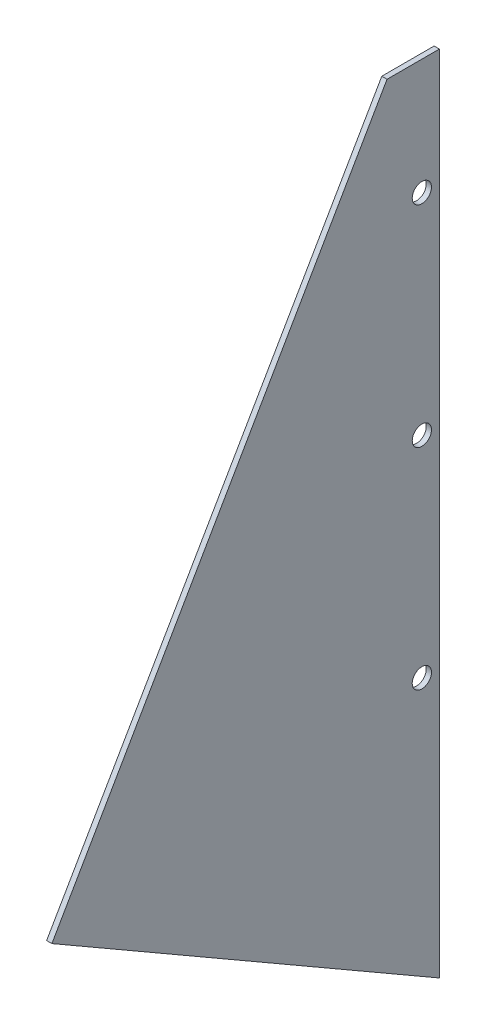
ISO-10303-21;
HEADER;
FILE_DESCRIPTION(('STEP AP214'),'2;1');
FILE_NAME('part.step','',(''),(''),'','','');
FILE_SCHEMA(('AUTOMOTIVE_DESIGN { 1 0 10303 214 1 1 1 1 }'));
ENDSEC;
DATA;
#1=APPLICATION_CONTEXT('core data for automotive mechanical design processes');
#2=APPLICATION_PROTOCOL_DEFINITION('international standard','automotive_design',2000,#1);
#3=PRODUCT_CONTEXT('',#1,'mechanical');
#4=PRODUCT('Part','Part','',(#3));
#5=PRODUCT_RELATED_PRODUCT_CATEGORY('part','',(#4));
#6=PRODUCT_DEFINITION_FORMATION('','',#4);
#7=PRODUCT_DEFINITION_CONTEXT('part definition',#1,'design');
#8=PRODUCT_DEFINITION('design','',#6,#7);
#9=PRODUCT_DEFINITION_SHAPE('','',#8);
#10=(LENGTH_UNIT() NAMED_UNIT(*) SI_UNIT(.MILLI.,.METRE.));
#11=(NAMED_UNIT(*) PLANE_ANGLE_UNIT() SI_UNIT($,.RADIAN.));
#12=(NAMED_UNIT(*) SI_UNIT($,.STERADIAN.) SOLID_ANGLE_UNIT());
#13=UNCERTAINTY_MEASURE_WITH_UNIT(LENGTH_MEASURE(1.E-05),#10,'distance_accuracy_value','');
#14=(GEOMETRIC_REPRESENTATION_CONTEXT(3) GLOBAL_UNCERTAINTY_ASSIGNED_CONTEXT((#13)) GLOBAL_UNIT_ASSIGNED_CONTEXT((#10,
#11,#12)) REPRESENTATION_CONTEXT('',''));
#15=CARTESIAN_POINT('',(0.,0.,0.));
#16=DIRECTION('',(0.,0.,1.));
#17=DIRECTION('',(1.,0.,0.));
#18=AXIS2_PLACEMENT_3D('',#15,#16,#17);
#19=CARTESIAN_POINT('',(1.5,0.,130.));
#20=DIRECTION('',(-1.,0.,0.));
#21=DIRECTION('',(0.,0.,1.));
#22=AXIS2_PLACEMENT_3D('',#19,#20,#21);
#23=PLANE('',#22);
#24=CARTESIAN_POINT('',(1.5,93.,5.));
#25=DIRECTION('',(-1.,0.,0.));
#26=DIRECTION('',(0.,0.,1.));
#27=AXIS2_PLACEMENT_3D('',#24,#25,#26);
#28=CIRCLE('',#27,2.75);
#29=CARTESIAN_POINT('',(1.5,93.,7.75));
#30=VERTEX_POINT('',#29);
#31=EDGE_CURVE('E107',#30,#30,#28,.T.);
#32=ORIENTED_EDGE('',*,*,#31,.T.);
#33=EDGE_LOOP('',(#32));
#34=FACE_BOUND('',#33,.T.);
#35=CARTESIAN_POINT('',(1.5,33.,5.));
#36=DIRECTION('',(-1.,0.,0.));
#37=DIRECTION('',(0.,0.,-1.));
#38=AXIS2_PLACEMENT_3D('',#35,#36,#37);
#39=CIRCLE('',#38,2.75);
#40=CARTESIAN_POINT('',(1.5,33.,2.25));
#41=VERTEX_POINT('',#40);
#42=EDGE_CURVE('E114',#41,#41,#39,.T.);
#43=ORIENTED_EDGE('',*,*,#42,.T.);
#44=EDGE_LOOP('',(#43));
#45=FACE_BOUND('',#44,.T.);
#46=CARTESIAN_POINT('',(1.5,153.,5.));
#47=DIRECTION('',(-1.,0.,0.));
#48=DIRECTION('',(0.,0.,1.));
#49=AXIS2_PLACEMENT_3D('',#46,#47,#48);
#50=CIRCLE('',#49,2.75);
#51=CARTESIAN_POINT('',(1.5,153.,7.75));
#52=VERTEX_POINT('',#51);
#53=EDGE_CURVE('E119',#52,#52,#50,.T.);
#54=ORIENTED_EDGE('',*,*,#53,.T.);
#55=EDGE_LOOP('',(#54));
#56=FACE_BOUND('',#55,.T.);
#57=DIRECTION('',(0.,-0.49971404204521,-0.866190438750532));
#58=VECTOR('',#57,1.);
#59=CARTESIAN_POINT('',(1.5,23.4608893177558,116.465175201123));
#60=LINE('',#59,#58);
#61=CARTESIAN_POINT('',(1.5,20.1042800833999,110.646921998708));
#62=VERTEX_POINT('',#61);
#63=CARTESIAN_POINT('',(1.5,-43.7290505079577,0.));
#64=VERTEX_POINT('',#63);
#65=EDGE_CURVE('E52',#62,#64,#60,.T.);
#66=ORIENTED_EDGE('',*,*,#65,.T.);
#67=DIRECTION('',(0.,1.,0.));
#68=VECTOR('',#67,1.);
#69=CARTESIAN_POINT('',(1.5,0.,0.));
#70=LINE('',#69,#68);
#71=CARTESIAN_POINT('',(1.5,186.,0.));
#72=VERTEX_POINT('',#71);
#73=EDGE_CURVE('E93',#64,#72,#70,.T.);
#74=ORIENTED_EDGE('',*,*,#73,.T.);
#75=DIRECTION('',(0.,0.,-1.));
#76=VECTOR('',#75,1.);
#77=CARTESIAN_POINT('',(1.5,186.,130.));
#78=LINE('',#77,#76);
#79=CARTESIAN_POINT('',(1.5,186.,14.94));
#80=VERTEX_POINT('',#79);
#81=EDGE_CURVE('E11',#80,#72,#78,.T.);
#82=ORIENTED_EDGE('',*,*,#81,.F.);
#83=DIRECTION('',(0.,-0.866190438750532,0.49971404204521));
#84=VECTOR('',#83,1.);
#85=CARTESIAN_POINT('',(1.5,-3.35660923435601,124.181746797586));
#86=LINE('',#85,#84);
#87=EDGE_CURVE('E99',#80,#62,#86,.T.);
#88=ORIENTED_EDGE('',*,*,#87,.T.);
#89=EDGE_LOOP('',(#66,#74,#82,#88));
#90=FACE_BOUND('',#89,.T.);
#91=ADVANCED_FACE('F38',(#34,#45,#56,#90),#23,.F.);
#92=CARTESIAN_POINT('',(0.,0.,130.));
#93=DIRECTION('',(-1.,0.,0.));
#94=DIRECTION('',(0.,0.,1.));
#95=AXIS2_PLACEMENT_3D('',#92,#93,#94);
#96=PLANE('',#95);
#97=CARTESIAN_POINT('',(0.,93.,5.));
#98=DIRECTION('',(-1.,0.,0.));
#99=DIRECTION('',(0.,0.,1.));
#100=AXIS2_PLACEMENT_3D('',#97,#98,#99);
#101=CIRCLE('',#100,2.75);
#102=CARTESIAN_POINT('',(0.,93.,7.75));
#103=VERTEX_POINT('',#102);
#104=EDGE_CURVE('E111',#103,#103,#101,.T.);
#105=ORIENTED_EDGE('',*,*,#104,.F.);
#106=EDGE_LOOP('',(#105));
#107=FACE_BOUND('',#106,.T.);
#108=CARTESIAN_POINT('',(0.,33.,5.));
#109=DIRECTION('',(-1.,0.,0.));
#110=DIRECTION('',(0.,0.,-1.));
#111=AXIS2_PLACEMENT_3D('',#108,#109,#110);
#112=CIRCLE('',#111,2.75);
#113=CARTESIAN_POINT('',(0.,33.,2.25));
#114=VERTEX_POINT('',#113);
#115=EDGE_CURVE('E106',#114,#114,#112,.T.);
#116=ORIENTED_EDGE('',*,*,#115,.F.);
#117=EDGE_LOOP('',(#116));
#118=FACE_BOUND('',#117,.T.);
#119=CARTESIAN_POINT('',(0.,153.,5.));
#120=DIRECTION('',(-1.,0.,0.));
#121=DIRECTION('',(0.,0.,1.));
#122=AXIS2_PLACEMENT_3D('',#119,#120,#121);
#123=CIRCLE('',#122,2.75);
#124=CARTESIAN_POINT('',(0.,153.,7.75));
#125=VERTEX_POINT('',#124);
#126=EDGE_CURVE('E110',#125,#125,#123,.T.);
#127=ORIENTED_EDGE('',*,*,#126,.F.);
#128=EDGE_LOOP('',(#127));
#129=FACE_BOUND('',#128,.T.);
#130=DIRECTION('',(0.,1.,0.));
#131=VECTOR('',#130,1.);
#132=CARTESIAN_POINT('',(0.,0.,0.));
#133=LINE('',#132,#131);
#134=CARTESIAN_POINT('',(0.,-43.7290505079577,0.));
#135=VERTEX_POINT('',#134);
#136=CARTESIAN_POINT('',(0.,186.,0.));
#137=VERTEX_POINT('',#136);
#138=EDGE_CURVE('E84',#135,#137,#133,.T.);
#139=ORIENTED_EDGE('',*,*,#138,.F.);
#140=DIRECTION('',(0.,-0.49971404204521,-0.866190438750532));
#141=VECTOR('',#140,1.);
#142=CARTESIAN_POINT('',(0.,23.4608893177558,116.465175201123));
#143=LINE('',#142,#141);
#144=CARTESIAN_POINT('',(0.,20.1042800833999,110.646921998708));
#145=VERTEX_POINT('',#144);
#146=EDGE_CURVE('E76',#145,#135,#143,.T.);
#147=ORIENTED_EDGE('',*,*,#146,.F.);
#148=DIRECTION('',(0.,-0.866190438750532,0.49971404204521));
#149=VECTOR('',#148,1.);
#150=CARTESIAN_POINT('',(0.,-3.35660923435601,124.181746797586));
#151=LINE('',#150,#149);
#152=CARTESIAN_POINT('',(0.,186.,14.94));
#153=VERTEX_POINT('',#152);
#154=EDGE_CURVE('E98',#153,#145,#151,.T.);
#155=ORIENTED_EDGE('',*,*,#154,.F.);
#156=DIRECTION('',(0.,0.,-1.));
#157=VECTOR('',#156,1.);
#158=CARTESIAN_POINT('',(0.,186.,130.));
#159=LINE('',#158,#157);
#160=EDGE_CURVE('E45',#153,#137,#159,.T.);
#161=ORIENTED_EDGE('',*,*,#160,.T.);
#162=EDGE_LOOP('',(#139,#147,#155,#161));
#163=FACE_BOUND('',#162,.T.);
#164=ADVANCED_FACE('F85',(#107,#118,#129,#163),#96,.T.);
#165=CARTESIAN_POINT('',(0.,-3.35660923435601,124.181746797586));
#166=DIRECTION('',(0.,-0.499714042045209,-0.866190438750532));
#167=DIRECTION('',(0.,-0.866190438750532,0.49971404204521));
#168=AXIS2_PLACEMENT_3D('',#165,#166,#167);
#169=PLANE('',#168);
#170=ORIENTED_EDGE('',*,*,#154,.T.);
#171=DIRECTION('',(1.,0.,0.));
#172=VECTOR('',#171,1.);
#173=CARTESIAN_POINT('',(1.5,20.1042800833999,110.646921998708));
#174=LINE('',#173,#172);
#175=EDGE_CURVE('E80',#62,#145,#174,.F.);
#176=ORIENTED_EDGE('',*,*,#175,.F.);
#177=ORIENTED_EDGE('',*,*,#87,.F.);
#178=DIRECTION('',(-1.,0.,0.));
#179=VECTOR('',#178,1.);
#180=CARTESIAN_POINT('',(0.,186.,14.94));
#181=LINE('',#180,#179);
#182=EDGE_CURVE('E102',#153,#80,#181,.F.);
#183=ORIENTED_EDGE('',*,*,#182,.F.);
#184=EDGE_LOOP('',(#170,#176,#177,#183));
#185=FACE_BOUND('',#184,.T.);
#186=ADVANCED_FACE('F130',(#185),#169,.F.);
#187=CARTESIAN_POINT('',(0.,186.,130.));
#188=DIRECTION('',(0.,1.,0.));
#189=DIRECTION('',(0.,0.,1.));
#190=AXIS2_PLACEMENT_3D('',#187,#188,#189);
#191=PLANE('',#190);
#192=ORIENTED_EDGE('',*,*,#160,.F.);
#193=ORIENTED_EDGE('',*,*,#182,.T.);
#194=ORIENTED_EDGE('',*,*,#81,.T.);
#195=DIRECTION('',(1.,0.,0.));
#196=VECTOR('',#195,1.);
#197=CARTESIAN_POINT('',(0.,186.,0.));
#198=LINE('',#197,#196);
#199=EDGE_CURVE('E88',#137,#72,#198,.T.);
#200=ORIENTED_EDGE('',*,*,#199,.F.);
#201=EDGE_LOOP('',(#192,#193,#194,#200));
#202=FACE_BOUND('',#201,.T.);
#203=ADVANCED_FACE('F126',(#202),#191,.T.);
#204=CARTESIAN_POINT('',(0.,0.,0.));
#205=DIRECTION('',(0.,0.,-1.));
#206=DIRECTION('',(-1.,0.,0.));
#207=AXIS2_PLACEMENT_3D('',#204,#205,#206);
#208=PLANE('',#207);
#209=ORIENTED_EDGE('',*,*,#73,.F.);
#210=DIRECTION('',(1.,0.,0.));
#211=VECTOR('',#210,1.);
#212=CARTESIAN_POINT('',(0.,-43.7290505079577,0.));
#213=LINE('',#212,#211);
#214=EDGE_CURVE('E79',#135,#64,#213,.T.);
#215=ORIENTED_EDGE('',*,*,#214,.F.);
#216=ORIENTED_EDGE('',*,*,#138,.T.);
#217=ORIENTED_EDGE('',*,*,#199,.T.);
#218=EDGE_LOOP('',(#209,#215,#216,#217));
#219=FACE_BOUND('',#218,.T.);
#220=ADVANCED_FACE('F91',(#219),#208,.T.);
#221=CARTESIAN_POINT('',(1.5,153.,5.));
#222=DIRECTION('',(-1.,0.,0.));
#223=DIRECTION('',(0.,0.,1.));
#224=AXIS2_PLACEMENT_3D('',#221,#222,#223);
#225=CYLINDRICAL_SURFACE('',#224,2.75);
#226=ORIENTED_EDGE('',*,*,#53,.F.);
#227=EDGE_LOOP('',(#226));
#228=FACE_BOUND('',#227,.T.);
#229=ORIENTED_EDGE('',*,*,#126,.T.);
#230=EDGE_LOOP('',(#229));
#231=FACE_BOUND('',#230,.T.);
#232=ADVANCED_FACE('F152',(#228,#231),#225,.F.);
#233=CARTESIAN_POINT('',(1.5,33.,5.));
#234=DIRECTION('',(-1.,0.,0.));
#235=DIRECTION('',(0.,0.,1.));
#236=AXIS2_PLACEMENT_3D('',#233,#234,#235);
#237=CYLINDRICAL_SURFACE('',#236,2.75);
#238=ORIENTED_EDGE('',*,*,#42,.F.);
#239=EDGE_LOOP('',(#238));
#240=FACE_BOUND('',#239,.T.);
#241=ORIENTED_EDGE('',*,*,#115,.T.);
#242=EDGE_LOOP('',(#241));
#243=FACE_BOUND('',#242,.T.);
#244=ADVANCED_FACE('F155',(#240,#243),#237,.F.);
#245=CARTESIAN_POINT('',(1.5,93.,5.));
#246=DIRECTION('',(-1.,0.,0.));
#247=DIRECTION('',(0.,0.,1.));
#248=AXIS2_PLACEMENT_3D('',#245,#246,#247);
#249=CYLINDRICAL_SURFACE('',#248,2.75);
#250=ORIENTED_EDGE('',*,*,#31,.F.);
#251=EDGE_LOOP('',(#250));
#252=FACE_BOUND('',#251,.T.);
#253=ORIENTED_EDGE('',*,*,#104,.T.);
#254=EDGE_LOOP('',(#253));
#255=FACE_BOUND('',#254,.T.);
#256=ADVANCED_FACE('F162',(#252,#255),#249,.F.);
#257=CARTESIAN_POINT('',(1.5,23.4608893177558,116.465175201123));
#258=DIRECTION('',(0.,0.866190438750532,-0.49971404204521));
#259=DIRECTION('',(0.,-0.49971404204521,-0.866190438750532));
#260=AXIS2_PLACEMENT_3D('',#257,#258,#259);
#261=PLANE('',#260);
#262=ORIENTED_EDGE('',*,*,#146,.T.);
#263=ORIENTED_EDGE('',*,*,#214,.T.);
#264=ORIENTED_EDGE('',*,*,#65,.F.);
#265=ORIENTED_EDGE('',*,*,#175,.T.);
#266=EDGE_LOOP('',(#262,#263,#264,#265));
#267=FACE_BOUND('',#266,.T.);
#268=ADVANCED_FACE('F77',(#267),#261,.F.);
#269=CLOSED_SHELL('',(#91,#164,#186,#203,#220,#232,#244,#256,#268));
#270=MANIFOLD_SOLID_BREP('B2',#269);
#271=ADVANCED_BREP_SHAPE_REPRESENTATION('',(#18,#270),#14);
#272=SHAPE_DEFINITION_REPRESENTATION(#9,#271);
ENDSEC;
END-ISO-10303-21;
